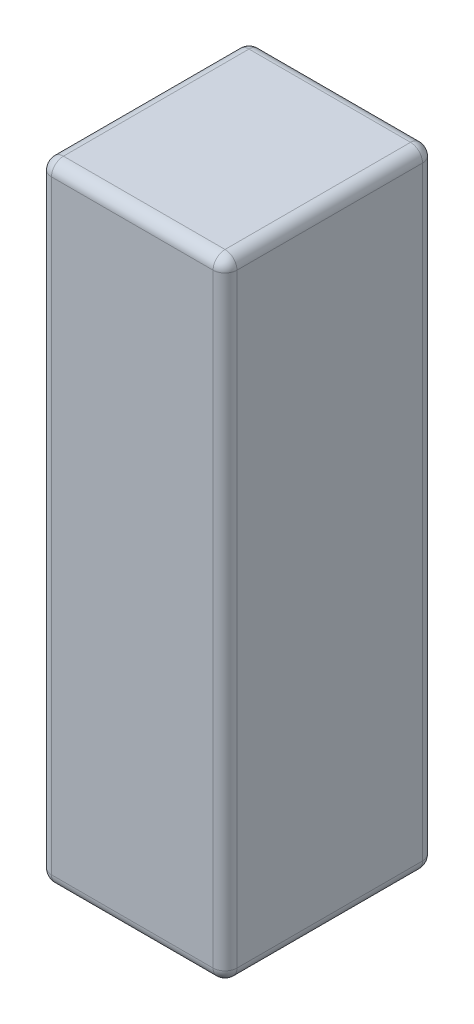
ISO-10303-21;
HEADER;
FILE_DESCRIPTION(('STEP AP214'),'2;1');
FILE_NAME('part.step','',(''),(''),'','','');
FILE_SCHEMA(('AUTOMOTIVE_DESIGN { 1 0 10303 214 1 1 1 1 }'));
ENDSEC;
DATA;
#1=APPLICATION_CONTEXT('core data for automotive mechanical design processes');
#2=APPLICATION_PROTOCOL_DEFINITION('international standard','automotive_design',2000,#1);
#3=PRODUCT_CONTEXT('',#1,'mechanical');
#4=PRODUCT('Part','Part','',(#3));
#5=PRODUCT_RELATED_PRODUCT_CATEGORY('part','',(#4));
#6=PRODUCT_DEFINITION_FORMATION('','',#4);
#7=PRODUCT_DEFINITION_CONTEXT('part definition',#1,'design');
#8=PRODUCT_DEFINITION('design','',#6,#7);
#9=PRODUCT_DEFINITION_SHAPE('','',#8);
#10=(LENGTH_UNIT() NAMED_UNIT(*) SI_UNIT(.MILLI.,.METRE.));
#11=(NAMED_UNIT(*) PLANE_ANGLE_UNIT() SI_UNIT($,.RADIAN.));
#12=(NAMED_UNIT(*) SI_UNIT($,.STERADIAN.) SOLID_ANGLE_UNIT());
#13=UNCERTAINTY_MEASURE_WITH_UNIT(LENGTH_MEASURE(1.E-05),#10,'distance_accuracy_value','');
#14=(GEOMETRIC_REPRESENTATION_CONTEXT(3) GLOBAL_UNCERTAINTY_ASSIGNED_CONTEXT((#13)) GLOBAL_UNIT_ASSIGNED_CONTEXT((#10,
#11,#12)) REPRESENTATION_CONTEXT('',''));
#15=CARTESIAN_POINT('',(0.,0.,0.));
#16=DIRECTION('',(0.,0.,1.));
#17=DIRECTION('',(1.,0.,0.));
#18=AXIS2_PLACEMENT_3D('',#15,#16,#17);
#19=CARTESIAN_POINT('',(0.,105.,0.));
#20=DIRECTION('',(1.,0.,0.));
#21=DIRECTION('',(0.,0.,-1.));
#22=AXIS2_PLACEMENT_3D('',#19,#20,#21);
#23=PLANE('',#22);
#24=DIRECTION('',(0.,0.,1.));
#25=VECTOR('',#24,1.);
#26=CARTESIAN_POINT('',(0.,103.,0.));
#27=LINE('',#26,#25);
#28=CARTESIAN_POINT('',(0.,103.,-2.));
#29=VERTEX_POINT('',#28);
#30=CARTESIAN_POINT('',(0.,103.,-33.));
#31=VERTEX_POINT('',#30);
#32=EDGE_CURVE('E187',#29,#31,#27,.F.);
#33=ORIENTED_EDGE('',*,*,#32,.T.);
#34=DIRECTION('',(0.,-1.,0.));
#35=VECTOR('',#34,1.);
#36=CARTESIAN_POINT('',(0.,105.,-33.));
#37=LINE('',#36,#35);
#38=CARTESIAN_POINT('',(0.,2.,-33.));
#39=VERTEX_POINT('',#38);
#40=EDGE_CURVE('E192',#31,#39,#37,.T.);
#41=ORIENTED_EDGE('',*,*,#40,.T.);
#42=DIRECTION('',(0.,0.,1.));
#43=VECTOR('',#42,1.);
#44=CARTESIAN_POINT('',(0.,2.,0.));
#45=LINE('',#44,#43);
#46=CARTESIAN_POINT('',(0.,2.,-2.));
#47=VERTEX_POINT('',#46);
#48=EDGE_CURVE('E189',#39,#47,#45,.T.);
#49=ORIENTED_EDGE('',*,*,#48,.T.);
#50=DIRECTION('',(0.,-1.,0.));
#51=VECTOR('',#50,1.);
#52=CARTESIAN_POINT('',(0.,105.,-2.));
#53=LINE('',#52,#51);
#54=EDGE_CURVE('E185',#47,#29,#53,.F.);
#55=ORIENTED_EDGE('',*,*,#54,.T.);
#56=EDGE_LOOP('',(#33,#41,#49,#55));
#57=FACE_BOUND('',#56,.T.);
#58=ADVANCED_FACE('F33',(#57),#23,.F.);
#59=CARTESIAN_POINT('',(0.,105.,0.));
#60=DIRECTION('',(0.,0.,-1.));
#61=DIRECTION('',(-1.,0.,0.));
#62=AXIS2_PLACEMENT_3D('',#59,#60,#61);
#63=PLANE('',#62);
#64=DIRECTION('',(1.,0.,0.));
#65=VECTOR('',#64,1.);
#66=CARTESIAN_POINT('',(0.,103.,0.));
#67=LINE('',#66,#65);
#68=CARTESIAN_POINT('',(29.,103.,0.));
#69=VERTEX_POINT('',#68);
#70=CARTESIAN_POINT('',(2.,103.,0.));
#71=VERTEX_POINT('',#70);
#72=EDGE_CURVE('E150',#69,#71,#67,.F.);
#73=ORIENTED_EDGE('',*,*,#72,.T.);
#74=DIRECTION('',(0.,-1.,0.));
#75=VECTOR('',#74,1.);
#76=CARTESIAN_POINT('',(2.,105.,0.));
#77=LINE('',#76,#75);
#78=CARTESIAN_POINT('',(2.,2.,0.));
#79=VERTEX_POINT('',#78);
#80=EDGE_CURVE('E154',#71,#79,#77,.T.);
#81=ORIENTED_EDGE('',*,*,#80,.T.);
#82=DIRECTION('',(1.,0.,0.));
#83=VECTOR('',#82,1.);
#84=CARTESIAN_POINT('',(31.,2.,0.));
#85=LINE('',#84,#83);
#86=CARTESIAN_POINT('',(29.,2.,0.));
#87=VERTEX_POINT('',#86);
#88=EDGE_CURVE('E126',#79,#87,#85,.T.);
#89=ORIENTED_EDGE('',*,*,#88,.T.);
#90=DIRECTION('',(0.,-1.,0.));
#91=VECTOR('',#90,1.);
#92=CARTESIAN_POINT('',(29.,105.,0.));
#93=LINE('',#92,#91);
#94=EDGE_CURVE('E144',#87,#69,#93,.F.);
#95=ORIENTED_EDGE('',*,*,#94,.T.);
#96=EDGE_LOOP('',(#73,#81,#89,#95));
#97=FACE_BOUND('',#96,.T.);
#98=ADVANCED_FACE('F152',(#97),#63,.F.);
#99=CARTESIAN_POINT('',(31.,105.,0.));
#100=DIRECTION('',(-1.,0.,0.));
#101=DIRECTION('',(0.,0.,1.));
#102=AXIS2_PLACEMENT_3D('',#99,#100,#101);
#103=PLANE('',#102);
#104=DIRECTION('',(0.,0.,-1.));
#105=VECTOR('',#104,1.);
#106=CARTESIAN_POINT('',(31.,2.,-35.));
#107=LINE('',#106,#105);
#108=CARTESIAN_POINT('',(31.,2.,-2.));
#109=VERTEX_POINT('',#108);
#110=CARTESIAN_POINT('',(31.,2.,-33.));
#111=VERTEX_POINT('',#110);
#112=EDGE_CURVE('E171',#109,#111,#107,.T.);
#113=ORIENTED_EDGE('',*,*,#112,.T.);
#114=DIRECTION('',(0.,-1.,0.));
#115=VECTOR('',#114,1.);
#116=CARTESIAN_POINT('',(31.,105.,-33.));
#117=LINE('',#116,#115);
#118=CARTESIAN_POINT('',(31.,103.,-33.));
#119=VERTEX_POINT('',#118);
#120=EDGE_CURVE('E174',#111,#119,#117,.F.);
#121=ORIENTED_EDGE('',*,*,#120,.T.);
#122=DIRECTION('',(0.,0.,-1.));
#123=VECTOR('',#122,1.);
#124=CARTESIAN_POINT('',(31.,103.,0.));
#125=LINE('',#124,#123);
#126=CARTESIAN_POINT('',(31.,103.,-2.));
#127=VERTEX_POINT('',#126);
#128=EDGE_CURVE('E169',#119,#127,#125,.F.);
#129=ORIENTED_EDGE('',*,*,#128,.T.);
#130=DIRECTION('',(0.,-1.,0.));
#131=VECTOR('',#130,1.);
#132=CARTESIAN_POINT('',(31.,105.,-2.));
#133=LINE('',#132,#131);
#134=EDGE_CURVE('E167',#127,#109,#133,.T.);
#135=ORIENTED_EDGE('',*,*,#134,.T.);
#136=EDGE_LOOP('',(#113,#121,#129,#135));
#137=FACE_BOUND('',#136,.T.);
#138=ADVANCED_FACE('F327',(#137),#103,.F.);
#139=CARTESIAN_POINT('',(0.,105.,-35.));
#140=DIRECTION('',(0.,0.,1.));
#141=DIRECTION('',(1.,0.,0.));
#142=AXIS2_PLACEMENT_3D('',#139,#140,#141);
#143=PLANE('',#142);
#144=DIRECTION('',(-1.,0.,0.));
#145=VECTOR('',#144,1.);
#146=CARTESIAN_POINT('',(0.,103.,-35.));
#147=LINE('',#146,#145);
#148=CARTESIAN_POINT('',(2.,103.,-35.));
#149=VERTEX_POINT('',#148);
#150=CARTESIAN_POINT('',(29.,103.,-35.));
#151=VERTEX_POINT('',#150);
#152=EDGE_CURVE('E178',#149,#151,#147,.F.);
#153=ORIENTED_EDGE('',*,*,#152,.T.);
#154=DIRECTION('',(0.,-1.,0.));
#155=VECTOR('',#154,1.);
#156=CARTESIAN_POINT('',(29.,105.,-35.));
#157=LINE('',#156,#155);
#158=CARTESIAN_POINT('',(29.,2.,-35.));
#159=VERTEX_POINT('',#158);
#160=EDGE_CURVE('E183',#151,#159,#157,.T.);
#161=ORIENTED_EDGE('',*,*,#160,.T.);
#162=DIRECTION('',(-1.,0.,0.));
#163=VECTOR('',#162,1.);
#164=CARTESIAN_POINT('',(0.,2.,-35.));
#165=LINE('',#164,#163);
#166=CARTESIAN_POINT('',(2.,2.,-35.));
#167=VERTEX_POINT('',#166);
#168=EDGE_CURVE('E180',#159,#167,#165,.T.);
#169=ORIENTED_EDGE('',*,*,#168,.T.);
#170=DIRECTION('',(0.,-1.,0.));
#171=VECTOR('',#170,1.);
#172=CARTESIAN_POINT('',(2.,105.,-35.));
#173=LINE('',#172,#171);
#174=EDGE_CURVE('E176',#167,#149,#173,.F.);
#175=ORIENTED_EDGE('',*,*,#174,.T.);
#176=EDGE_LOOP('',(#153,#161,#169,#175));
#177=FACE_BOUND('',#176,.T.);
#178=ADVANCED_FACE('F294',(#177),#143,.F.);
#179=CARTESIAN_POINT('',(0.,105.,0.));
#180=DIRECTION('',(0.,-1.,0.));
#181=DIRECTION('',(0.,0.,-1.));
#182=AXIS2_PLACEMENT_3D('',#179,#180,#181);
#183=PLANE('',#182);
#184=DIRECTION('',(0.,0.,-1.));
#185=VECTOR('',#184,1.);
#186=CARTESIAN_POINT('',(29.,105.,0.));
#187=LINE('',#186,#185);
#188=CARTESIAN_POINT('',(29.,105.,-2.));
#189=VERTEX_POINT('',#188);
#190=CARTESIAN_POINT('',(29.,105.,-33.));
#191=VERTEX_POINT('',#190);
#192=EDGE_CURVE('E42',#189,#191,#187,.T.);
#193=ORIENTED_EDGE('',*,*,#192,.T.);
#194=DIRECTION('',(-1.,0.,0.));
#195=VECTOR('',#194,1.);
#196=CARTESIAN_POINT('',(0.,105.,-33.));
#197=LINE('',#196,#195);
#198=CARTESIAN_POINT('',(2.,105.,-33.));
#199=VERTEX_POINT('',#198);
#200=EDGE_CURVE('E11',#191,#199,#197,.T.);
#201=ORIENTED_EDGE('',*,*,#200,.T.);
#202=DIRECTION('',(0.,0.,1.));
#203=VECTOR('',#202,1.);
#204=CARTESIAN_POINT('',(2.,105.,0.));
#205=LINE('',#204,#203);
#206=CARTESIAN_POINT('',(2.,105.,-2.));
#207=VERTEX_POINT('',#206);
#208=EDGE_CURVE('E194',#199,#207,#205,.T.);
#209=ORIENTED_EDGE('',*,*,#208,.T.);
#210=DIRECTION('',(1.,0.,0.));
#211=VECTOR('',#210,1.);
#212=CARTESIAN_POINT('',(0.,105.,-2.));
#213=LINE('',#212,#211);
#214=EDGE_CURVE('E53',#207,#189,#213,.T.);
#215=ORIENTED_EDGE('',*,*,#214,.T.);
#216=EDGE_LOOP('',(#193,#201,#209,#215));
#217=FACE_BOUND('',#216,.T.);
#218=ADVANCED_FACE('F274',(#217),#183,.F.);
#219=CARTESIAN_POINT('',(0.,0.,0.));
#220=DIRECTION('',(0.,-1.,0.));
#221=DIRECTION('',(0.,0.,-1.));
#222=AXIS2_PLACEMENT_3D('',#219,#220,#221);
#223=PLANE('',#222);
#224=DIRECTION('',(0.,0.,-1.));
#225=VECTOR('',#224,1.);
#226=CARTESIAN_POINT('',(29.,0.,0.));
#227=LINE('',#226,#225);
#228=CARTESIAN_POINT('',(29.,0.,-33.));
#229=VERTEX_POINT('',#228);
#230=CARTESIAN_POINT('',(29.,0.,-2.));
#231=VERTEX_POINT('',#230);
#232=EDGE_CURVE('E164',#229,#231,#227,.F.);
#233=ORIENTED_EDGE('',*,*,#232,.T.);
#234=DIRECTION('',(1.,0.,0.));
#235=VECTOR('',#234,1.);
#236=CARTESIAN_POINT('',(0.,0.,-2.));
#237=LINE('',#236,#235);
#238=CARTESIAN_POINT('',(2.,0.,-2.));
#239=VERTEX_POINT('',#238);
#240=EDGE_CURVE('E128',#231,#239,#237,.F.);
#241=ORIENTED_EDGE('',*,*,#240,.T.);
#242=DIRECTION('',(0.,0.,1.));
#243=VECTOR('',#242,1.);
#244=CARTESIAN_POINT('',(2.,0.,-35.));
#245=LINE('',#244,#243);
#246=CARTESIAN_POINT('',(2.,0.,-33.));
#247=VERTEX_POINT('',#246);
#248=EDGE_CURVE('E157',#239,#247,#245,.F.);
#249=ORIENTED_EDGE('',*,*,#248,.T.);
#250=DIRECTION('',(-1.,0.,0.));
#251=VECTOR('',#250,1.);
#252=CARTESIAN_POINT('',(31.,0.,-33.));
#253=LINE('',#252,#251);
#254=EDGE_CURVE('E162',#247,#229,#253,.F.);
#255=ORIENTED_EDGE('',*,*,#254,.T.);
#256=EDGE_LOOP('',(#233,#241,#249,#255));
#257=FACE_BOUND('',#256,.T.);
#258=ADVANCED_FACE('F355',(#257),#223,.T.);
#259=CARTESIAN_POINT('',(0.,103.,-33.));
#260=DIRECTION('',(-1.,0.,0.));
#261=DIRECTION('',(0.,0.,1.));
#262=AXIS2_PLACEMENT_3D('',#259,#260,#261);
#263=CYLINDRICAL_SURFACE('',#262,2.);
#264=CARTESIAN_POINT('',(2.,103.,-33.));
#265=DIRECTION('',(-1.,0.,0.));
#266=DIRECTION('',(0.,0.,1.));
#267=AXIS2_PLACEMENT_3D('',#264,#265,#266);
#268=CIRCLE('',#267,2.);
#269=EDGE_CURVE('E37',#199,#149,#268,.T.);
#270=ORIENTED_EDGE('',*,*,#269,.F.);
#271=ORIENTED_EDGE('',*,*,#200,.F.);
#272=CARTESIAN_POINT('',(29.,103.,-33.));
#273=DIRECTION('',(1.,0.,0.));
#274=DIRECTION('',(0.,0.,-1.));
#275=AXIS2_PLACEMENT_3D('',#272,#273,#274);
#276=CIRCLE('',#275,2.);
#277=EDGE_CURVE('E247',#151,#191,#276,.T.);
#278=ORIENTED_EDGE('',*,*,#277,.F.);
#279=ORIENTED_EDGE('',*,*,#152,.F.);
#280=EDGE_LOOP('',(#270,#271,#278,#279));
#281=FACE_BOUND('',#280,.T.);
#282=ADVANCED_FACE('F35',(#281),#263,.T.);
#283=CARTESIAN_POINT('',(2.,103.,-33.));
#284=DIRECTION('',(0.,0.,1.));
#285=DIRECTION('',(1.,0.,0.));
#286=AXIS2_PLACEMENT_3D('',#283,#284,#285);
#287=SPHERICAL_SURFACE('',#286,2.);
#288=CARTESIAN_POINT('',(2.,103.,-33.));
#289=DIRECTION('',(0.,0.,-1.));
#290=DIRECTION('',(-1.,0.,0.));
#291=AXIS2_PLACEMENT_3D('',#288,#289,#290);
#292=CIRCLE('',#291,2.);
#293=EDGE_CURVE('E242',#199,#31,#292,.F.);
#294=ORIENTED_EDGE('',*,*,#293,.F.);
#295=ORIENTED_EDGE('',*,*,#269,.T.);
#296=CARTESIAN_POINT('',(2.,103.,-33.));
#297=DIRECTION('',(0.,1.,0.));
#298=DIRECTION('',(0.,0.,1.));
#299=AXIS2_PLACEMENT_3D('',#296,#297,#298);
#300=CIRCLE('',#299,2.);
#301=EDGE_CURVE('E245',#31,#149,#300,.F.);
#302=ORIENTED_EDGE('',*,*,#301,.F.);
#303=EDGE_LOOP('',(#294,#295,#302));
#304=FACE_BOUND('',#303,.T.);
#305=ADVANCED_FACE('F258',(#304),#287,.T.);
#306=CARTESIAN_POINT('',(29.,103.,-33.));
#307=DIRECTION('',(0.,0.,1.));
#308=DIRECTION('',(1.,0.,0.));
#309=AXIS2_PLACEMENT_3D('',#306,#307,#308);
#310=SPHERICAL_SURFACE('',#309,2.);
#311=CARTESIAN_POINT('',(29.,103.,-33.));
#312=DIRECTION('',(0.,1.,0.));
#313=DIRECTION('',(0.,0.,1.));
#314=AXIS2_PLACEMENT_3D('',#311,#312,#313);
#315=CIRCLE('',#314,2.);
#316=EDGE_CURVE('E236',#151,#119,#315,.F.);
#317=ORIENTED_EDGE('',*,*,#316,.F.);
#318=ORIENTED_EDGE('',*,*,#277,.T.);
#319=CARTESIAN_POINT('',(29.,103.,-33.));
#320=DIRECTION('',(0.,0.,-1.));
#321=DIRECTION('',(-1.,0.,0.));
#322=AXIS2_PLACEMENT_3D('',#319,#320,#321);
#323=CIRCLE('',#322,2.);
#324=EDGE_CURVE('E239',#119,#191,#323,.F.);
#325=ORIENTED_EDGE('',*,*,#324,.F.);
#326=EDGE_LOOP('',(#317,#318,#325));
#327=FACE_BOUND('',#326,.T.);
#328=ADVANCED_FACE('F286',(#327),#310,.T.);
#329=CARTESIAN_POINT('',(2.,105.,-33.));
#330=DIRECTION('',(0.,-1.,0.));
#331=DIRECTION('',(0.,0.,-1.));
#332=AXIS2_PLACEMENT_3D('',#329,#330,#331);
#333=CYLINDRICAL_SURFACE('',#332,2.);
#334=ORIENTED_EDGE('',*,*,#301,.T.);
#335=ORIENTED_EDGE('',*,*,#174,.F.);
#336=CARTESIAN_POINT('',(2.,2.,-33.));
#337=DIRECTION('',(0.,-1.,0.));
#338=DIRECTION('',(0.,0.,-1.));
#339=AXIS2_PLACEMENT_3D('',#336,#337,#338);
#340=CIRCLE('',#339,2.);
#341=EDGE_CURVE('E231',#39,#167,#340,.T.);
#342=ORIENTED_EDGE('',*,*,#341,.F.);
#343=ORIENTED_EDGE('',*,*,#40,.F.);
#344=EDGE_LOOP('',(#334,#335,#342,#343));
#345=FACE_BOUND('',#344,.T.);
#346=ADVANCED_FACE('F264',(#345),#333,.T.);
#347=CARTESIAN_POINT('',(2.,103.,0.));
#348=DIRECTION('',(0.,0.,1.));
#349=DIRECTION('',(1.,0.,0.));
#350=AXIS2_PLACEMENT_3D('',#347,#348,#349);
#351=CYLINDRICAL_SURFACE('',#350,2.);
#352=ORIENTED_EDGE('',*,*,#293,.T.);
#353=ORIENTED_EDGE('',*,*,#32,.F.);
#354=CARTESIAN_POINT('',(2.,103.,-2.));
#355=DIRECTION('',(0.,0.,1.));
#356=DIRECTION('',(1.,0.,0.));
#357=AXIS2_PLACEMENT_3D('',#354,#355,#356);
#358=CIRCLE('',#357,2.);
#359=EDGE_CURVE('E228',#207,#29,#358,.T.);
#360=ORIENTED_EDGE('',*,*,#359,.F.);
#361=ORIENTED_EDGE('',*,*,#208,.F.);
#362=EDGE_LOOP('',(#352,#353,#360,#361));
#363=FACE_BOUND('',#362,.T.);
#364=ADVANCED_FACE('F273',(#363),#351,.T.);
#365=CARTESIAN_POINT('',(0.,103.,-2.));
#366=DIRECTION('',(1.,0.,0.));
#367=DIRECTION('',(0.,0.,-1.));
#368=AXIS2_PLACEMENT_3D('',#365,#366,#367);
#369=CYLINDRICAL_SURFACE('',#368,2.);
#370=CARTESIAN_POINT('',(29.,103.,-2.));
#371=DIRECTION('',(1.,0.,0.));
#372=DIRECTION('',(0.,0.,-1.));
#373=AXIS2_PLACEMENT_3D('',#370,#371,#372);
#374=CIRCLE('',#373,2.);
#375=EDGE_CURVE('E222',#189,#69,#374,.T.);
#376=ORIENTED_EDGE('',*,*,#375,.F.);
#377=ORIENTED_EDGE('',*,*,#214,.F.);
#378=CARTESIAN_POINT('',(2.,103.,-2.));
#379=DIRECTION('',(-1.,0.,0.));
#380=DIRECTION('',(0.,0.,1.));
#381=AXIS2_PLACEMENT_3D('',#378,#379,#380);
#382=CIRCLE('',#381,2.);
#383=EDGE_CURVE('E225',#71,#207,#382,.T.);
#384=ORIENTED_EDGE('',*,*,#383,.F.);
#385=ORIENTED_EDGE('',*,*,#72,.F.);
#386=EDGE_LOOP('',(#376,#377,#384,#385));
#387=FACE_BOUND('',#386,.T.);
#388=ADVANCED_FACE('F278',(#387),#369,.T.);
#389=CARTESIAN_POINT('',(29.,103.,0.));
#390=DIRECTION('',(0.,0.,-1.));
#391=DIRECTION('',(-1.,0.,0.));
#392=AXIS2_PLACEMENT_3D('',#389,#390,#391);
#393=CYLINDRICAL_SURFACE('',#392,2.);
#394=ORIENTED_EDGE('',*,*,#324,.T.);
#395=ORIENTED_EDGE('',*,*,#192,.F.);
#396=CARTESIAN_POINT('',(29.,103.,-2.));
#397=DIRECTION('',(0.,0.,1.));
#398=DIRECTION('',(1.,0.,0.));
#399=AXIS2_PLACEMENT_3D('',#396,#397,#398);
#400=CIRCLE('',#399,2.);
#401=EDGE_CURVE('E219',#127,#189,#400,.T.);
#402=ORIENTED_EDGE('',*,*,#401,.F.);
#403=ORIENTED_EDGE('',*,*,#128,.F.);
#404=EDGE_LOOP('',(#394,#395,#402,#403));
#405=FACE_BOUND('',#404,.T.);
#406=ADVANCED_FACE('F285',(#405),#393,.T.);
#407=CARTESIAN_POINT('',(29.,105.,-33.));
#408=DIRECTION('',(0.,-1.,0.));
#409=DIRECTION('',(0.,0.,-1.));
#410=AXIS2_PLACEMENT_3D('',#407,#408,#409);
#411=CYLINDRICAL_SURFACE('',#410,2.);
#412=ORIENTED_EDGE('',*,*,#316,.T.);
#413=ORIENTED_EDGE('',*,*,#120,.F.);
#414=CARTESIAN_POINT('',(29.,2.,-33.));
#415=DIRECTION('',(0.,-1.,0.));
#416=DIRECTION('',(0.,0.,-1.));
#417=AXIS2_PLACEMENT_3D('',#414,#415,#416);
#418=CIRCLE('',#417,2.);
#419=EDGE_CURVE('E216',#159,#111,#418,.T.);
#420=ORIENTED_EDGE('',*,*,#419,.F.);
#421=ORIENTED_EDGE('',*,*,#160,.F.);
#422=EDGE_LOOP('',(#412,#413,#420,#421));
#423=FACE_BOUND('',#422,.T.);
#424=ADVANCED_FACE('F291',(#423),#411,.T.);
#425=CARTESIAN_POINT('',(0.,2.,-33.));
#426=DIRECTION('',(1.,0.,0.));
#427=DIRECTION('',(0.,0.,-1.));
#428=AXIS2_PLACEMENT_3D('',#425,#426,#427);
#429=CYLINDRICAL_SURFACE('',#428,2.);
#430=CARTESIAN_POINT('',(2.,2.,-33.));
#431=DIRECTION('',(-1.,0.,0.));
#432=DIRECTION('',(0.,0.,1.));
#433=AXIS2_PLACEMENT_3D('',#430,#431,#432);
#434=CIRCLE('',#433,2.);
#435=EDGE_CURVE('E233',#167,#247,#434,.T.);
#436=ORIENTED_EDGE('',*,*,#435,.F.);
#437=ORIENTED_EDGE('',*,*,#168,.F.);
#438=CARTESIAN_POINT('',(29.,2.,-33.));
#439=DIRECTION('',(1.,0.,0.));
#440=DIRECTION('',(0.,0.,-1.));
#441=AXIS2_PLACEMENT_3D('',#438,#439,#440);
#442=CIRCLE('',#441,2.);
#443=EDGE_CURVE('E213',#229,#159,#442,.T.);
#444=ORIENTED_EDGE('',*,*,#443,.F.);
#445=ORIENTED_EDGE('',*,*,#254,.F.);
#446=EDGE_LOOP('',(#436,#437,#444,#445));
#447=FACE_BOUND('',#446,.T.);
#448=ADVANCED_FACE('F298',(#447),#429,.T.);
#449=CARTESIAN_POINT('',(2.,2.,-33.));
#450=DIRECTION('',(0.,0.,1.));
#451=DIRECTION('',(1.,0.,0.));
#452=AXIS2_PLACEMENT_3D('',#449,#450,#451);
#453=SPHERICAL_SURFACE('',#452,2.);
#454=ORIENTED_EDGE('',*,*,#341,.T.);
#455=ORIENTED_EDGE('',*,*,#435,.T.);
#456=CARTESIAN_POINT('',(2.,2.,-33.));
#457=DIRECTION('',(0.,0.,-1.));
#458=DIRECTION('',(-1.,0.,0.));
#459=AXIS2_PLACEMENT_3D('',#456,#457,#458);
#460=CIRCLE('',#459,2.);
#461=EDGE_CURVE('E210',#39,#247,#460,.F.);
#462=ORIENTED_EDGE('',*,*,#461,.F.);
#463=EDGE_LOOP('',(#454,#455,#462));
#464=FACE_BOUND('',#463,.T.);
#465=ADVANCED_FACE('F302',(#464),#453,.T.);
#466=CARTESIAN_POINT('',(2.,103.,-2.));
#467=DIRECTION('',(0.,0.,1.));
#468=DIRECTION('',(1.,0.,0.));
#469=AXIS2_PLACEMENT_3D('',#466,#467,#468);
#470=SPHERICAL_SURFACE('',#469,2.);
#471=ORIENTED_EDGE('',*,*,#383,.T.);
#472=ORIENTED_EDGE('',*,*,#359,.T.);
#473=CARTESIAN_POINT('',(2.,103.,-2.));
#474=DIRECTION('',(0.,1.,0.));
#475=DIRECTION('',(0.,0.,1.));
#476=AXIS2_PLACEMENT_3D('',#473,#474,#475);
#477=CIRCLE('',#476,2.);
#478=EDGE_CURVE('E207',#71,#29,#477,.F.);
#479=ORIENTED_EDGE('',*,*,#478,.F.);
#480=EDGE_LOOP('',(#471,#472,#479));
#481=FACE_BOUND('',#480,.T.);
#482=ADVANCED_FACE('F312',(#481),#470,.T.);
#483=CARTESIAN_POINT('',(29.,103.,-2.));
#484=DIRECTION('',(0.,0.,1.));
#485=DIRECTION('',(1.,0.,0.));
#486=AXIS2_PLACEMENT_3D('',#483,#484,#485);
#487=SPHERICAL_SURFACE('',#486,2.);
#488=ORIENTED_EDGE('',*,*,#401,.T.);
#489=ORIENTED_EDGE('',*,*,#375,.T.);
#490=CARTESIAN_POINT('',(29.,103.,-2.));
#491=DIRECTION('',(0.,1.,0.));
#492=DIRECTION('',(0.,0.,1.));
#493=AXIS2_PLACEMENT_3D('',#490,#491,#492);
#494=CIRCLE('',#493,2.);
#495=EDGE_CURVE('E147',#127,#69,#494,.F.);
#496=ORIENTED_EDGE('',*,*,#495,.F.);
#497=EDGE_LOOP('',(#488,#489,#496));
#498=FACE_BOUND('',#497,.T.);
#499=ADVANCED_FACE('F282',(#498),#487,.T.);
#500=CARTESIAN_POINT('',(29.,2.,-33.));
#501=DIRECTION('',(0.,0.,1.));
#502=DIRECTION('',(1.,0.,0.));
#503=AXIS2_PLACEMENT_3D('',#500,#501,#502);
#504=SPHERICAL_SURFACE('',#503,2.);
#505=ORIENTED_EDGE('',*,*,#443,.T.);
#506=ORIENTED_EDGE('',*,*,#419,.T.);
#507=CARTESIAN_POINT('',(29.,2.,-33.));
#508=DIRECTION('',(0.,0.,-1.));
#509=DIRECTION('',(-1.,0.,0.));
#510=AXIS2_PLACEMENT_3D('',#507,#508,#509);
#511=CIRCLE('',#510,2.);
#512=EDGE_CURVE('E204',#229,#111,#511,.F.);
#513=ORIENTED_EDGE('',*,*,#512,.F.);
#514=EDGE_LOOP('',(#505,#506,#513));
#515=FACE_BOUND('',#514,.T.);
#516=ADVANCED_FACE('F319',(#515),#504,.T.);
#517=CARTESIAN_POINT('',(2.,2.,0.));
#518=DIRECTION('',(0.,0.,-1.));
#519=DIRECTION('',(-1.,0.,0.));
#520=AXIS2_PLACEMENT_3D('',#517,#518,#519);
#521=CYLINDRICAL_SURFACE('',#520,2.);
#522=ORIENTED_EDGE('',*,*,#461,.T.);
#523=ORIENTED_EDGE('',*,*,#248,.F.);
#524=CARTESIAN_POINT('',(2.,2.,-2.));
#525=DIRECTION('',(0.,0.,1.));
#526=DIRECTION('',(1.,0.,0.));
#527=AXIS2_PLACEMENT_3D('',#524,#525,#526);
#528=CIRCLE('',#527,2.);
#529=EDGE_CURVE('E201',#47,#239,#528,.T.);
#530=ORIENTED_EDGE('',*,*,#529,.F.);
#531=ORIENTED_EDGE('',*,*,#48,.F.);
#532=EDGE_LOOP('',(#522,#523,#530,#531));
#533=FACE_BOUND('',#532,.T.);
#534=ADVANCED_FACE('F305',(#533),#521,.T.);
#535=CARTESIAN_POINT('',(2.,105.,-2.));
#536=DIRECTION('',(0.,-1.,0.));
#537=DIRECTION('',(0.,0.,-1.));
#538=AXIS2_PLACEMENT_3D('',#535,#536,#537);
#539=CYLINDRICAL_SURFACE('',#538,2.);
#540=ORIENTED_EDGE('',*,*,#478,.T.);
#541=ORIENTED_EDGE('',*,*,#54,.F.);
#542=CARTESIAN_POINT('',(2.,2.,-2.));
#543=DIRECTION('',(0.,-1.,0.));
#544=DIRECTION('',(0.,0.,-1.));
#545=AXIS2_PLACEMENT_3D('',#542,#543,#544);
#546=CIRCLE('',#545,2.);
#547=EDGE_CURVE('E141',#79,#47,#546,.T.);
#548=ORIENTED_EDGE('',*,*,#547,.F.);
#549=ORIENTED_EDGE('',*,*,#80,.F.);
#550=EDGE_LOOP('',(#540,#541,#548,#549));
#551=FACE_BOUND('',#550,.T.);
#552=ADVANCED_FACE('F310',(#551),#539,.T.);
#553=CARTESIAN_POINT('',(29.,105.,-2.));
#554=DIRECTION('',(0.,-1.,0.));
#555=DIRECTION('',(0.,0.,-1.));
#556=AXIS2_PLACEMENT_3D('',#553,#554,#555);
#557=CYLINDRICAL_SURFACE('',#556,2.);
#558=ORIENTED_EDGE('',*,*,#495,.T.);
#559=ORIENTED_EDGE('',*,*,#94,.F.);
#560=CARTESIAN_POINT('',(29.,2.,-2.));
#561=DIRECTION('',(0.,-1.,0.));
#562=DIRECTION('',(0.,0.,-1.));
#563=AXIS2_PLACEMENT_3D('',#560,#561,#562);
#564=CIRCLE('',#563,2.);
#565=EDGE_CURVE('E134',#109,#87,#564,.T.);
#566=ORIENTED_EDGE('',*,*,#565,.F.);
#567=ORIENTED_EDGE('',*,*,#134,.F.);
#568=EDGE_LOOP('',(#558,#559,#566,#567));
#569=FACE_BOUND('',#568,.T.);
#570=ADVANCED_FACE('F145',(#569),#557,.T.);
#571=CARTESIAN_POINT('',(29.,2.,0.));
#572=DIRECTION('',(0.,0.,1.));
#573=DIRECTION('',(1.,0.,0.));
#574=AXIS2_PLACEMENT_3D('',#571,#572,#573);
#575=CYLINDRICAL_SURFACE('',#574,2.);
#576=ORIENTED_EDGE('',*,*,#512,.T.);
#577=ORIENTED_EDGE('',*,*,#112,.F.);
#578=CARTESIAN_POINT('',(29.,2.,-2.));
#579=DIRECTION('',(0.,0.,1.));
#580=DIRECTION('',(1.,0.,0.));
#581=AXIS2_PLACEMENT_3D('',#578,#579,#580);
#582=CIRCLE('',#581,2.);
#583=EDGE_CURVE('E138',#231,#109,#582,.T.);
#584=ORIENTED_EDGE('',*,*,#583,.F.);
#585=ORIENTED_EDGE('',*,*,#232,.F.);
#586=EDGE_LOOP('',(#576,#577,#584,#585));
#587=FACE_BOUND('',#586,.T.);
#588=ADVANCED_FACE('F338',(#587),#575,.T.);
#589=CARTESIAN_POINT('',(2.,2.,-2.));
#590=DIRECTION('',(0.,0.,1.));
#591=DIRECTION('',(1.,0.,0.));
#592=AXIS2_PLACEMENT_3D('',#589,#590,#591);
#593=SPHERICAL_SURFACE('',#592,2.);
#594=ORIENTED_EDGE('',*,*,#547,.T.);
#595=ORIENTED_EDGE('',*,*,#529,.T.);
#596=CARTESIAN_POINT('',(2.,2.,-2.));
#597=DIRECTION('',(-1.,0.,0.));
#598=DIRECTION('',(0.,0.,1.));
#599=AXIS2_PLACEMENT_3D('',#596,#597,#598);
#600=CIRCLE('',#599,2.);
#601=EDGE_CURVE('E131',#79,#239,#600,.F.);
#602=ORIENTED_EDGE('',*,*,#601,.F.);
#603=EDGE_LOOP('',(#594,#595,#602));
#604=FACE_BOUND('',#603,.T.);
#605=ADVANCED_FACE('F335',(#604),#593,.T.);
#606=CARTESIAN_POINT('',(29.,2.,-2.));
#607=DIRECTION('',(0.,0.,1.));
#608=DIRECTION('',(1.,0.,0.));
#609=AXIS2_PLACEMENT_3D('',#606,#607,#608);
#610=SPHERICAL_SURFACE('',#609,2.);
#611=ORIENTED_EDGE('',*,*,#583,.T.);
#612=ORIENTED_EDGE('',*,*,#565,.T.);
#613=CARTESIAN_POINT('',(29.,2.,-2.));
#614=DIRECTION('',(1.,0.,0.));
#615=DIRECTION('',(0.,0.,-1.));
#616=AXIS2_PLACEMENT_3D('',#613,#614,#615);
#617=CIRCLE('',#616,2.);
#618=EDGE_CURVE('E122',#231,#87,#617,.F.);
#619=ORIENTED_EDGE('',*,*,#618,.F.);
#620=EDGE_LOOP('',(#611,#612,#619));
#621=FACE_BOUND('',#620,.T.);
#622=ADVANCED_FACE('F136',(#621),#610,.T.);
#623=CARTESIAN_POINT('',(0.,2.,-2.));
#624=DIRECTION('',(-1.,0.,0.));
#625=DIRECTION('',(0.,0.,1.));
#626=AXIS2_PLACEMENT_3D('',#623,#624,#625);
#627=CYLINDRICAL_SURFACE('',#626,2.);
#628=ORIENTED_EDGE('',*,*,#601,.T.);
#629=ORIENTED_EDGE('',*,*,#240,.F.);
#630=ORIENTED_EDGE('',*,*,#618,.T.);
#631=ORIENTED_EDGE('',*,*,#88,.F.);
#632=EDGE_LOOP('',(#628,#629,#630,#631));
#633=FACE_BOUND('',#632,.T.);
#634=ADVANCED_FACE('F124',(#633),#627,.T.);
#635=CLOSED_SHELL('',(#58,#98,#138,#178,#218,#258,#282,#305,#328,#346,#364,#388,#406,#424,#448,
#465,#482,#499,#516,#534,#552,#570,#588,#605,#622,#634));
#636=MANIFOLD_SOLID_BREP('B2',#635);
#637=ADVANCED_BREP_SHAPE_REPRESENTATION('',(#18,#636),#14);
#638=SHAPE_DEFINITION_REPRESENTATION(#9,#637);
ENDSEC;
END-ISO-10303-21;
